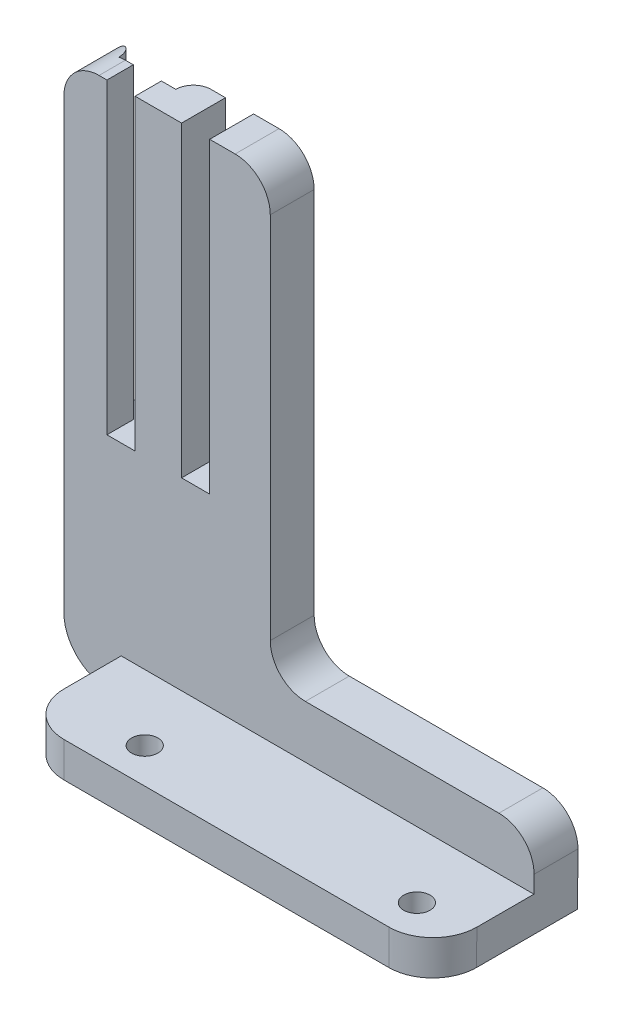
ISO-10303-21;
HEADER;
FILE_DESCRIPTION(('STEP AP214'),'2;1');
FILE_NAME('part.step','',(''),(''),'','','');
FILE_SCHEMA(('AUTOMOTIVE_DESIGN { 1 0 10303 214 1 1 1 1 }'));
ENDSEC;
DATA;
#1=APPLICATION_CONTEXT('core data for automotive mechanical design processes');
#2=APPLICATION_PROTOCOL_DEFINITION('international standard','automotive_design',2000,#1);
#3=PRODUCT_CONTEXT('',#1,'mechanical');
#4=PRODUCT('Part','Part','',(#3));
#5=PRODUCT_RELATED_PRODUCT_CATEGORY('part','',(#4));
#6=PRODUCT_DEFINITION_FORMATION('','',#4);
#7=PRODUCT_DEFINITION_CONTEXT('part definition',#1,'design');
#8=PRODUCT_DEFINITION('design','',#6,#7);
#9=PRODUCT_DEFINITION_SHAPE('','',#8);
#10=(LENGTH_UNIT() NAMED_UNIT(*) SI_UNIT(.MILLI.,.METRE.));
#11=(NAMED_UNIT(*) PLANE_ANGLE_UNIT() SI_UNIT($,.RADIAN.));
#12=(NAMED_UNIT(*) SI_UNIT($,.STERADIAN.) SOLID_ANGLE_UNIT());
#13=UNCERTAINTY_MEASURE_WITH_UNIT(LENGTH_MEASURE(1.E-05),#10,'distance_accuracy_value','');
#14=(GEOMETRIC_REPRESENTATION_CONTEXT(3) GLOBAL_UNCERTAINTY_ASSIGNED_CONTEXT((#13)) GLOBAL_UNIT_ASSIGNED_CONTEXT((#10,
#11,#12)) REPRESENTATION_CONTEXT('',''));
#15=CARTESIAN_POINT('',(0.,0.,0.));
#16=DIRECTION('',(0.,0.,1.));
#17=DIRECTION('',(1.,0.,0.));
#18=AXIS2_PLACEMENT_3D('',#15,#16,#17);
#19=CARTESIAN_POINT('',(-20.8166666666667,0.,5.));
#20=DIRECTION('',(1.,0.,0.));
#21=DIRECTION('',(0.,1.,0.));
#22=AXIS2_PLACEMENT_3D('',#19,#20,#21);
#23=PLANE('',#22);
#24=DIRECTION('',(0.,0.,-1.));
#25=VECTOR('',#24,1.);
#26=CARTESIAN_POINT('',(-20.8166666666667,35.,5.));
#27=LINE('',#26,#25);
#28=CARTESIAN_POINT('',(-20.8166666666667,35.,5.));
#29=VERTEX_POINT('',#28);
#30=CARTESIAN_POINT('',(-20.8166666666667,35.,2.));
#31=VERTEX_POINT('',#30);
#32=EDGE_CURVE('E337',#29,#31,#27,.T.);
#33=ORIENTED_EDGE('',*,*,#32,.T.);
#34=DIRECTION('',(0.,-1.,0.));
#35=VECTOR('',#34,1.);
#36=CARTESIAN_POINT('',(-20.8166666666667,0.,2.));
#37=LINE('',#36,#35);
#38=CARTESIAN_POINT('',(-20.8166666666667,0.,2.));
#39=VERTEX_POINT('',#38);
#40=EDGE_CURVE('E238',#31,#39,#37,.T.);
#41=ORIENTED_EDGE('',*,*,#40,.T.);
#42=DIRECTION('',(0.,0.,-1.));
#43=VECTOR('',#42,1.);
#44=CARTESIAN_POINT('',(-20.8166666666667,0.,5.));
#45=LINE('',#44,#43);
#46=CARTESIAN_POINT('',(-20.8166666666667,0.,5.));
#47=VERTEX_POINT('',#46);
#48=EDGE_CURVE('E288',#47,#39,#45,.T.);
#49=ORIENTED_EDGE('',*,*,#48,.F.);
#50=DIRECTION('',(0.,-1.,0.));
#51=VECTOR('',#50,1.);
#52=CARTESIAN_POINT('',(-20.8166666666667,0.,5.));
#53=LINE('',#52,#51);
#54=EDGE_CURVE('E362',#29,#47,#53,.T.);
#55=ORIENTED_EDGE('',*,*,#54,.F.);
#56=EDGE_LOOP('',(#33,#41,#49,#55));
#57=FACE_BOUND('',#56,.T.);
#58=ADVANCED_FACE('F33',(#57),#23,.F.);
#59=CARTESIAN_POINT('',(-20.8166666666667,0.,5.));
#60=DIRECTION('',(0.,-1.,0.));
#61=DIRECTION('',(1.,0.,0.));
#62=AXIS2_PLACEMENT_3D('',#59,#60,#61);
#63=PLANE('',#62);
#64=ORIENTED_EDGE('',*,*,#48,.T.);
#65=DIRECTION('',(1.,0.,0.));
#66=VECTOR('',#65,1.);
#67=CARTESIAN_POINT('',(-25.6666666666667,0.,2.));
#68=LINE('',#67,#66);
#69=CARTESIAN_POINT('',(-19.1666666666667,0.,2.));
#70=VERTEX_POINT('',#69);
#71=EDGE_CURVE('E248',#39,#70,#68,.T.);
#72=ORIENTED_EDGE('',*,*,#71,.T.);
#73=CARTESIAN_POINT('',(-17.1666666666667,0.,2.));
#74=DIRECTION('',(0.,-1.,0.));
#75=DIRECTION('',(1.,0.,0.));
#76=AXIS2_PLACEMENT_3D('',#73,#74,#75);
#77=CIRCLE('',#76,2.);
#78=CARTESIAN_POINT('',(-17.1666666666667,0.,0.));
#79=VERTEX_POINT('',#78);
#80=EDGE_CURVE('E42',#70,#79,#77,.T.);
#81=ORIENTED_EDGE('',*,*,#80,.T.);
#82=DIRECTION('',(-1.,0.,0.));
#83=VECTOR('',#82,1.);
#84=CARTESIAN_POINT('',(-20.8166666666667,0.,0.));
#85=LINE('',#84,#83);
#86=CARTESIAN_POINT('',(-27.6666666666667,0.,0.));
#87=VERTEX_POINT('',#86);
#88=EDGE_CURVE('E49',#79,#87,#85,.T.);
#89=ORIENTED_EDGE('',*,*,#88,.T.);
#90=CARTESIAN_POINT('',(-27.6666666666667,0.,2.));
#91=DIRECTION('',(0.,-1.,0.));
#92=DIRECTION('',(1.,0.,0.));
#93=AXIS2_PLACEMENT_3D('',#90,#91,#92);
#94=CIRCLE('',#93,2.);
#95=CARTESIAN_POINT('',(-25.6666666666667,0.,2.));
#96=VERTEX_POINT('',#95);
#97=EDGE_CURVE('E11',#87,#96,#94,.T.);
#98=ORIENTED_EDGE('',*,*,#97,.T.);
#99=CARTESIAN_POINT('',(-24.0166666666667,0.,2.));
#100=VERTEX_POINT('',#99);
#101=EDGE_CURVE('E243',#96,#100,#68,.T.);
#102=ORIENTED_EDGE('',*,*,#101,.T.);
#103=DIRECTION('',(0.,0.,-1.));
#104=VECTOR('',#103,1.);
#105=CARTESIAN_POINT('',(-24.0166666666667,0.,5.));
#106=LINE('',#105,#104);
#107=CARTESIAN_POINT('',(-24.0166666666667,0.,5.));
#108=VERTEX_POINT('',#107);
#109=EDGE_CURVE('E380',#108,#100,#106,.T.);
#110=ORIENTED_EDGE('',*,*,#109,.F.);
#111=DIRECTION('',(-1.,0.,0.));
#112=VECTOR('',#111,1.);
#113=CARTESIAN_POINT('',(-20.8166666666667,0.,5.));
#114=LINE('',#113,#112);
#115=EDGE_CURVE('E388',#47,#108,#114,.T.);
#116=ORIENTED_EDGE('',*,*,#115,.F.);
#117=EDGE_LOOP('',(#64,#72,#81,#89,#98,#102,#110,#116));
#118=FACE_BOUND('',#117,.T.);
#119=ADVANCED_FACE('F387',(#118),#63,.F.);
#120=CARTESIAN_POINT('',(-24.0166666666667,0.,5.));
#121=DIRECTION('',(-1.,0.,0.));
#122=DIRECTION('',(0.,-1.,0.));
#123=AXIS2_PLACEMENT_3D('',#120,#121,#122);
#124=PLANE('',#123);
#125=ORIENTED_EDGE('',*,*,#109,.T.);
#126=DIRECTION('',(0.,1.,0.));
#127=VECTOR('',#126,1.);
#128=CARTESIAN_POINT('',(-24.0166666666667,0.,2.));
#129=LINE('',#128,#127);
#130=CARTESIAN_POINT('',(-24.0166666666667,35.,2.));
#131=VERTEX_POINT('',#130);
#132=EDGE_CURVE('E242',#100,#131,#129,.T.);
#133=ORIENTED_EDGE('',*,*,#132,.T.);
#134=DIRECTION('',(0.,0.,-1.));
#135=VECTOR('',#134,1.);
#136=CARTESIAN_POINT('',(-24.0166666666667,35.,5.));
#137=LINE('',#136,#135);
#138=CARTESIAN_POINT('',(-24.0166666666667,35.,5.));
#139=VERTEX_POINT('',#138);
#140=EDGE_CURVE('E378',#139,#131,#137,.T.);
#141=ORIENTED_EDGE('',*,*,#140,.F.);
#142=DIRECTION('',(0.,1.,0.));
#143=VECTOR('',#142,1.);
#144=CARTESIAN_POINT('',(-24.0166666666667,0.,5.));
#145=LINE('',#144,#143);
#146=EDGE_CURVE('E545',#108,#139,#145,.T.);
#147=ORIENTED_EDGE('',*,*,#146,.F.);
#148=EDGE_LOOP('',(#125,#133,#141,#147));
#149=FACE_BOUND('',#148,.T.);
#150=ADVANCED_FACE('F452',(#149),#124,.F.);
#151=CARTESIAN_POINT('',(-24.0166666666667,35.,5.));
#152=DIRECTION('',(0.,-1.,0.));
#153=DIRECTION('',(0.,0.,-1.));
#154=AXIS2_PLACEMENT_3D('',#151,#152,#153);
#155=PLANE('',#154);
#156=ORIENTED_EDGE('',*,*,#140,.T.);
#157=DIRECTION('',(1.,0.,0.));
#158=VECTOR('',#157,1.);
#159=CARTESIAN_POINT('',(-25.6666666666667,35.,2.));
#160=LINE('',#159,#158);
#161=CARTESIAN_POINT('',(-24.9166666666667,35.,2.));
#162=VERTEX_POINT('',#161);
#163=EDGE_CURVE('E239',#162,#131,#160,.T.);
#164=ORIENTED_EDGE('',*,*,#163,.F.);
#165=DIRECTION('',(0.,0.,-1.));
#166=VECTOR('',#165,1.);
#167=CARTESIAN_POINT('',(-24.9166666666667,35.,5.));
#168=LINE('',#167,#166);
#169=CARTESIAN_POINT('',(-24.9166666666667,35.,5.));
#170=VERTEX_POINT('',#169);
#171=EDGE_CURVE('E487',#162,#170,#168,.F.);
#172=ORIENTED_EDGE('',*,*,#171,.T.);
#173=DIRECTION('',(-1.,0.,0.));
#174=VECTOR('',#173,1.);
#175=CARTESIAN_POINT('',(-24.0166666666667,35.,5.));
#176=LINE('',#175,#174);
#177=EDGE_CURVE('E540',#139,#170,#176,.T.);
#178=ORIENTED_EDGE('',*,*,#177,.F.);
#179=EDGE_LOOP('',(#156,#164,#172,#178));
#180=FACE_BOUND('',#179,.T.);
#181=ADVANCED_FACE('F532',(#180),#155,.F.);
#182=CARTESIAN_POINT('',(-28.9166666666667,-25.,5.));
#183=DIRECTION('',(1.,0.,0.));
#184=DIRECTION('',(0.,0.,-1.));
#185=AXIS2_PLACEMENT_3D('',#182,#183,#184);
#186=PLANE('',#185);
#187=DIRECTION('',(0.,-1.,0.));
#188=VECTOR('',#187,1.);
#189=CARTESIAN_POINT('',(-28.9166666666667,-25.,0.));
#190=LINE('',#189,#188);
#191=CARTESIAN_POINT('',(-28.9166666666667,31.,0.));
#192=VERTEX_POINT('',#191);
#193=CARTESIAN_POINT('',(-28.9166666666667,-20.,0.));
#194=VERTEX_POINT('',#193);
#195=EDGE_CURVE('E339',#192,#194,#190,.T.);
#196=ORIENTED_EDGE('',*,*,#195,.T.);
#197=DIRECTION('',(0.,0.,-1.));
#198=VECTOR('',#197,1.);
#199=CARTESIAN_POINT('',(-28.9166666666667,-20.,5.));
#200=LINE('',#199,#198);
#201=CARTESIAN_POINT('',(-28.9166666666667,-20.,5.));
#202=VERTEX_POINT('',#201);
#203=EDGE_CURVE('E521',#194,#202,#200,.F.);
#204=ORIENTED_EDGE('',*,*,#203,.T.);
#205=DIRECTION('',(0.,-1.,0.));
#206=VECTOR('',#205,1.);
#207=CARTESIAN_POINT('',(-28.9166666666667,-25.,5.));
#208=LINE('',#207,#206);
#209=CARTESIAN_POINT('',(-28.9166666666667,31.,5.));
#210=VERTEX_POINT('',#209);
#211=EDGE_CURVE('E516',#210,#202,#208,.T.);
#212=ORIENTED_EDGE('',*,*,#211,.F.);
#213=DIRECTION('',(0.,0.,-1.));
#214=VECTOR('',#213,1.);
#215=CARTESIAN_POINT('',(-28.9166666666667,31.,5.));
#216=LINE('',#215,#214);
#217=EDGE_CURVE('E475',#210,#192,#216,.T.);
#218=ORIENTED_EDGE('',*,*,#217,.T.);
#219=EDGE_LOOP('',(#196,#204,#212,#218));
#220=FACE_BOUND('',#219,.T.);
#221=ADVANCED_FACE('F542',(#220),#186,.F.);
#222=CARTESIAN_POINT('',(24.5834077517131,-25.,5.));
#223=DIRECTION('',(0.,1.,0.));
#224=DIRECTION('',(0.,0.,1.));
#225=AXIS2_PLACEMENT_3D('',#222,#223,#224);
#226=PLANE('',#225);
#227=CARTESIAN_POINT('',(18.7852470457038,-25.,12.5014817246109));
#228=DIRECTION('',(0.,1.,0.));
#229=DIRECTION('',(0.,0.,1.));
#230=AXIS2_PLACEMENT_3D('',#227,#228,#229);
#231=CIRCLE('',#230,1.5);
#232=CARTESIAN_POINT('',(18.7852470457038,-25.,14.0014817246109));
#233=VERTEX_POINT('',#232);
#234=EDGE_CURVE('E257',#233,#233,#231,.F.);
#235=ORIENTED_EDGE('',*,*,#234,.F.);
#236=EDGE_LOOP('',(#235));
#237=FACE_BOUND('',#236,.T.);
#238=CARTESIAN_POINT('',(-12.2147529542962,-25.,12.5014817246109));
#239=DIRECTION('',(0.,1.,0.));
#240=DIRECTION('',(0.,0.,1.));
#241=AXIS2_PLACEMENT_3D('',#238,#239,#240);
#242=CIRCLE('',#241,1.5);
#243=CARTESIAN_POINT('',(-12.2147529542962,-25.,14.0014817246109));
#244=VERTEX_POINT('',#243);
#245=EDGE_CURVE('E263',#244,#244,#242,.F.);
#246=ORIENTED_EDGE('',*,*,#245,.F.);
#247=EDGE_LOOP('',(#246));
#248=FACE_BOUND('',#247,.T.);
#249=DIRECTION('',(1.,0.,0.));
#250=VECTOR('',#249,1.);
#251=CARTESIAN_POINT('',(24.5834077517131,-25.,5.));
#252=LINE('',#251,#250);
#253=CARTESIAN_POINT('',(-23.9166666666667,-25.,5.));
#254=VERTEX_POINT('',#253);
#255=CARTESIAN_POINT('',(-22.3948764519901,-25.,5.));
#256=VERTEX_POINT('',#255);
#257=EDGE_CURVE('E315',#254,#256,#252,.T.);
#258=ORIENTED_EDGE('',*,*,#257,.F.);
#259=DIRECTION('',(0.,0.,-1.));
#260=VECTOR('',#259,1.);
#261=CARTESIAN_POINT('',(-23.9166666666667,-25.,5.));
#262=LINE('',#261,#260);
#263=CARTESIAN_POINT('',(-23.9166666666667,-25.,0.));
#264=VERTEX_POINT('',#263);
#265=EDGE_CURVE('E514',#254,#264,#262,.T.);
#266=ORIENTED_EDGE('',*,*,#265,.T.);
#267=DIRECTION('',(1.,0.,0.));
#268=VECTOR('',#267,1.);
#269=CARTESIAN_POINT('',(24.5834077517131,-25.,0.));
#270=LINE('',#269,#268);
#271=CARTESIAN_POINT('',(24.5834077517131,-25.,0.));
#272=VERTEX_POINT('',#271);
#273=EDGE_CURVE('E342',#264,#272,#270,.T.);
#274=ORIENTED_EDGE('',*,*,#273,.T.);
#275=DIRECTION('',(0.,0.,-1.));
#276=VECTOR('',#275,1.);
#277=CARTESIAN_POINT('',(24.5834077517131,-25.,5.));
#278=LINE('',#277,#276);
#279=CARTESIAN_POINT('',(24.5834077517131,-25.,11.5));
#280=VERTEX_POINT('',#279);
#281=EDGE_CURVE('E375',#280,#272,#278,.T.);
#282=ORIENTED_EDGE('',*,*,#281,.F.);
#283=CARTESIAN_POINT('',(19.5832589149536,-25.,11.5));
#284=DIRECTION('',(0.,1.,0.));
#285=DIRECTION('',(1.,0.,0.));
#286=AXIS2_PLACEMENT_3D('',#283,#284,#285);
#287=ELLIPSE('',#286,5.00014883675949,5.);
#288=CARTESIAN_POINT('',(19.5832589149536,-25.,16.5));
#289=VERTEX_POINT('',#288);
#290=EDGE_CURVE('E291',#280,#289,#287,.F.);
#291=ORIENTED_EDGE('',*,*,#290,.T.);
#292=DIRECTION('',(1.,0.,0.));
#293=VECTOR('',#292,1.);
#294=CARTESIAN_POINT('',(-22.3948764519902,-25.,16.5));
#295=LINE('',#294,#293);
#296=CARTESIAN_POINT('',(-17.3948764519902,-25.,16.5));
#297=VERTEX_POINT('',#296);
#298=EDGE_CURVE('E267',#297,#289,#295,.T.);
#299=ORIENTED_EDGE('',*,*,#298,.F.);
#300=CARTESIAN_POINT('',(-17.3948764519902,-25.,11.5));
#301=DIRECTION('',(0.,1.,0.));
#302=DIRECTION('',(0.,0.,1.));
#303=AXIS2_PLACEMENT_3D('',#300,#301,#302);
#304=CIRCLE('',#303,5.);
#305=CARTESIAN_POINT('',(-22.3948764519902,-25.,11.5));
#306=VERTEX_POINT('',#305);
#307=EDGE_CURVE('E297',#297,#306,#304,.F.);
#308=ORIENTED_EDGE('',*,*,#307,.T.);
#309=DIRECTION('',(0.,0.,-1.));
#310=VECTOR('',#309,1.);
#311=CARTESIAN_POINT('',(-22.3948764519902,-25.,16.5));
#312=LINE('',#311,#310);
#313=EDGE_CURVE('E292',#306,#256,#312,.T.);
#314=ORIENTED_EDGE('',*,*,#313,.T.);
#315=EDGE_LOOP('',(#258,#266,#274,#282,#291,#299,#308,#314));
#316=FACE_BOUND('',#315,.T.);
#317=ADVANCED_FACE('F555',(#237,#248,#316),#226,.F.);
#318=CARTESIAN_POINT('',(24.5834077517131,-25.,5.));
#319=DIRECTION('',(-0.999970233534172,0.00771570123931044,0.));
#320=DIRECTION('',(-0.00771570123931045,-0.999970233534172,0.));
#321=AXIS2_PLACEMENT_3D('',#318,#319,#320);
#322=PLANE('',#321);
#323=DIRECTION('',(0.00771570123931044,0.999970233534171,0.));
#324=VECTOR('',#323,1.);
#325=CARTESIAN_POINT('',(24.5834077517131,-25.,0.));
#326=LINE('',#325,#324);
#327=CARTESIAN_POINT('',(24.629465201934,-19.0308628049572,0.));
#328=VERTEX_POINT('',#327);
#329=EDGE_CURVE('E344',#272,#328,#326,.T.);
#330=ORIENTED_EDGE('',*,*,#329,.T.);
#331=DIRECTION('',(0.,0.,-1.));
#332=VECTOR('',#331,1.);
#333=CARTESIAN_POINT('',(24.629465201934,-19.0308628049572,5.));
#334=LINE('',#333,#332);
#335=CARTESIAN_POINT('',(24.629465201934,-19.0308628049572,5.));
#336=VERTEX_POINT('',#335);
#337=EDGE_CURVE('E500',#328,#336,#334,.F.);
#338=ORIENTED_EDGE('',*,*,#337,.T.);
#339=DIRECTION('',(0.00771570123931044,0.999970233534171,0.));
#340=VECTOR('',#339,1.);
#341=CARTESIAN_POINT('',(24.5834077517131,-25.,5.));
#342=LINE('',#341,#340);
#343=CARTESIAN_POINT('',(24.6142714753743,-21.,5.));
#344=VERTEX_POINT('',#343);
#345=EDGE_CURVE('E310',#344,#336,#342,.T.);
#346=ORIENTED_EDGE('',*,*,#345,.F.);
#347=DIRECTION('',(0.,0.,-1.));
#348=VECTOR('',#347,1.);
#349=CARTESIAN_POINT('',(24.6142714753743,-21.,16.5));
#350=LINE('',#349,#348);
#351=CARTESIAN_POINT('',(24.6142714753743,-21.,11.5));
#352=VERTEX_POINT('',#351);
#353=EDGE_CURVE('E295',#352,#344,#350,.T.);
#354=ORIENTED_EDGE('',*,*,#353,.F.);
#355=DIRECTION('',(0.00771570123931045,0.999970233534172,0.));
#356=VECTOR('',#355,1.);
#357=CARTESIAN_POINT('',(24.5834077517131,-25.,11.5));
#358=LINE('',#357,#356);
#359=EDGE_CURVE('E474',#352,#280,#358,.F.);
#360=ORIENTED_EDGE('',*,*,#359,.T.);
#361=ORIENTED_EDGE('',*,*,#281,.T.);
#362=EDGE_LOOP('',(#330,#338,#346,#354,#360,#361));
#363=FACE_BOUND('',#362,.T.);
#364=ADVANCED_FACE('F566',(#363),#322,.F.);
#365=CARTESIAN_POINT('',(24.6605670608661,-15.,5.));
#366=DIRECTION('',(0.,-1.,0.));
#367=DIRECTION('',(1.,0.,0.));
#368=AXIS2_PLACEMENT_3D('',#365,#366,#367);
#369=PLANE('',#368);
#370=DIRECTION('',(-1.,0.,0.));
#371=VECTOR('',#370,1.);
#372=CARTESIAN_POINT('',(24.6605670608661,-15.,5.));
#373=LINE('',#372,#371);
#374=CARTESIAN_POINT('',(20.6295842677973,-15.,5.));
#375=VERTEX_POINT('',#374);
#376=CARTESIAN_POINT('',(-1.41666666666663,-15.,5.));
#377=VERTEX_POINT('',#376);
#378=EDGE_CURVE('E314',#375,#377,#373,.T.);
#379=ORIENTED_EDGE('',*,*,#378,.F.);
#380=DIRECTION('',(0.,0.,-1.));
#381=VECTOR('',#380,1.);
#382=CARTESIAN_POINT('',(20.6295842677973,-15.,5.));
#383=LINE('',#382,#381);
#384=CARTESIAN_POINT('',(20.6295842677973,-15.,0.));
#385=VERTEX_POINT('',#384);
#386=EDGE_CURVE('E497',#375,#385,#383,.T.);
#387=ORIENTED_EDGE('',*,*,#386,.T.);
#388=DIRECTION('',(-1.,0.,0.));
#389=VECTOR('',#388,1.);
#390=CARTESIAN_POINT('',(24.6605670608661,-15.,0.));
#391=LINE('',#390,#389);
#392=CARTESIAN_POINT('',(-1.41666666666663,-15.,0.));
#393=VERTEX_POINT('',#392);
#394=EDGE_CURVE('E347',#385,#393,#391,.T.);
#395=ORIENTED_EDGE('',*,*,#394,.T.);
#396=DIRECTION('',(0.,0.,-1.));
#397=VECTOR('',#396,1.);
#398=CARTESIAN_POINT('',(-1.41666666666662,-15.,5.));
#399=LINE('',#398,#397);
#400=EDGE_CURVE('E495',#393,#377,#399,.F.);
#401=ORIENTED_EDGE('',*,*,#400,.T.);
#402=EDGE_LOOP('',(#379,#387,#395,#401));
#403=FACE_BOUND('',#402,.T.);
#404=ADVANCED_FACE('F608',(#403),#369,.F.);
#405=CARTESIAN_POINT('',(-5.41666666666662,-15.,5.));
#406=DIRECTION('',(-1.,0.,0.));
#407=DIRECTION('',(0.,-1.,0.));
#408=AXIS2_PLACEMENT_3D('',#405,#406,#407);
#409=PLANE('',#408);
#410=DIRECTION('',(0.,1.,0.));
#411=VECTOR('',#410,1.);
#412=CARTESIAN_POINT('',(-5.41666666666662,-15.,5.));
#413=LINE('',#412,#411);
#414=CARTESIAN_POINT('',(-5.41666666666662,-11.,5.));
#415=VERTEX_POINT('',#414);
#416=CARTESIAN_POINT('',(-5.41666666666665,31.,5.));
#417=VERTEX_POINT('',#416);
#418=EDGE_CURVE('E324',#415,#417,#413,.T.);
#419=ORIENTED_EDGE('',*,*,#418,.F.);
#420=DIRECTION('',(0.,0.,-1.));
#421=VECTOR('',#420,1.);
#422=CARTESIAN_POINT('',(-5.41666666666662,-11.,0.));
#423=LINE('',#422,#421);
#424=CARTESIAN_POINT('',(-5.41666666666662,-11.,0.));
#425=VERTEX_POINT('',#424);
#426=EDGE_CURVE('E504',#415,#425,#423,.T.);
#427=ORIENTED_EDGE('',*,*,#426,.T.);
#428=DIRECTION('',(0.,1.,0.));
#429=VECTOR('',#428,1.);
#430=CARTESIAN_POINT('',(-5.41666666666662,-15.,0.));
#431=LINE('',#430,#429);
#432=CARTESIAN_POINT('',(-5.41666666666665,31.,0.));
#433=VERTEX_POINT('',#432);
#434=EDGE_CURVE('E350',#425,#433,#431,.T.);
#435=ORIENTED_EDGE('',*,*,#434,.T.);
#436=DIRECTION('',(0.,0.,-1.));
#437=VECTOR('',#436,1.);
#438=CARTESIAN_POINT('',(-5.41666666666665,31.,5.));
#439=LINE('',#438,#437);
#440=EDGE_CURVE('E502',#433,#417,#439,.F.);
#441=ORIENTED_EDGE('',*,*,#440,.T.);
#442=EDGE_LOOP('',(#419,#427,#435,#441));
#443=FACE_BOUND('',#442,.T.);
#444=ADVANCED_FACE('F604',(#443),#409,.F.);
#445=CARTESIAN_POINT('',(-5.41666666666665,35.,5.));
#446=DIRECTION('',(0.,-1.,0.));
#447=DIRECTION('',(1.,0.,0.));
#448=AXIS2_PLACEMENT_3D('',#445,#446,#447);
#449=PLANE('',#448);
#450=DIRECTION('',(-1.,0.,0.));
#451=VECTOR('',#450,1.);
#452=CARTESIAN_POINT('',(-5.41666666666665,35.,5.));
#453=LINE('',#452,#451);
#454=CARTESIAN_POINT('',(-9.41666666666665,35.,5.));
#455=VERTEX_POINT('',#454);
#456=CARTESIAN_POINT('',(-12.3166666666666,35.,5.));
#457=VERTEX_POINT('',#456);
#458=EDGE_CURVE('E327',#455,#457,#453,.T.);
#459=ORIENTED_EDGE('',*,*,#458,.F.);
#460=DIRECTION('',(0.,0.,-1.));
#461=VECTOR('',#460,1.);
#462=CARTESIAN_POINT('',(-9.41666666666665,35.,5.));
#463=LINE('',#462,#461);
#464=CARTESIAN_POINT('',(-9.41666666666665,35.,0.));
#465=VERTEX_POINT('',#464);
#466=EDGE_CURVE('E507',#455,#465,#463,.T.);
#467=ORIENTED_EDGE('',*,*,#466,.T.);
#468=DIRECTION('',(-1.,0.,0.));
#469=VECTOR('',#468,1.);
#470=CARTESIAN_POINT('',(-5.41666666666665,35.,0.));
#471=LINE('',#470,#469);
#472=CARTESIAN_POINT('',(-12.3166666666666,35.,0.));
#473=VERTEX_POINT('',#472);
#474=EDGE_CURVE('E353',#465,#473,#471,.T.);
#475=ORIENTED_EDGE('',*,*,#474,.T.);
#476=DIRECTION('',(0.,0.,-1.));
#477=VECTOR('',#476,1.);
#478=CARTESIAN_POINT('',(-12.3166666666666,35.,5.));
#479=LINE('',#478,#477);
#480=EDGE_CURVE('E372',#457,#473,#479,.T.);
#481=ORIENTED_EDGE('',*,*,#480,.F.);
#482=EDGE_LOOP('',(#459,#467,#475,#481));
#483=FACE_BOUND('',#482,.T.);
#484=ADVANCED_FACE('F600',(#483),#449,.F.);
#485=CARTESIAN_POINT('',(-12.3166666666666,0.,5.));
#486=DIRECTION('',(1.,0.,0.));
#487=DIRECTION('',(0.,1.,0.));
#488=AXIS2_PLACEMENT_3D('',#485,#486,#487);
#489=PLANE('',#488);
#490=DIRECTION('',(0.,-1.,0.));
#491=VECTOR('',#490,1.);
#492=CARTESIAN_POINT('',(-12.3166666666666,0.,0.));
#493=LINE('',#492,#491);
#494=CARTESIAN_POINT('',(-12.3166666666666,0.,0.));
#495=VERTEX_POINT('',#494);
#496=EDGE_CURVE('E355',#473,#495,#493,.T.);
#497=ORIENTED_EDGE('',*,*,#496,.T.);
#498=DIRECTION('',(0.,0.,-1.));
#499=VECTOR('',#498,1.);
#500=CARTESIAN_POINT('',(-12.3166666666666,0.,5.));
#501=LINE('',#500,#499);
#502=CARTESIAN_POINT('',(-12.3166666666666,0.,5.));
#503=VERTEX_POINT('',#502);
#504=EDGE_CURVE('E369',#503,#495,#501,.T.);
#505=ORIENTED_EDGE('',*,*,#504,.F.);
#506=DIRECTION('',(0.,-1.,0.));
#507=VECTOR('',#506,1.);
#508=CARTESIAN_POINT('',(-12.3166666666666,0.,5.));
#509=LINE('',#508,#507);
#510=EDGE_CURVE('E329',#457,#503,#509,.T.);
#511=ORIENTED_EDGE('',*,*,#510,.F.);
#512=ORIENTED_EDGE('',*,*,#480,.T.);
#513=EDGE_LOOP('',(#497,#505,#511,#512));
#514=FACE_BOUND('',#513,.T.);
#515=ADVANCED_FACE('F596',(#514),#489,.F.);
#516=CARTESIAN_POINT('',(-12.3166666666666,0.,5.));
#517=DIRECTION('',(0.,-1.,0.));
#518=DIRECTION('',(1.,0.,0.));
#519=AXIS2_PLACEMENT_3D('',#516,#517,#518);
#520=PLANE('',#519);
#521=DIRECTION('',(-1.,0.,0.));
#522=VECTOR('',#521,1.);
#523=CARTESIAN_POINT('',(-12.3166666666666,0.,0.));
#524=LINE('',#523,#522);
#525=CARTESIAN_POINT('',(-15.5166666666666,0.,0.));
#526=VERTEX_POINT('',#525);
#527=EDGE_CURVE('E357',#495,#526,#524,.T.);
#528=ORIENTED_EDGE('',*,*,#527,.T.);
#529=DIRECTION('',(0.,0.,-1.));
#530=VECTOR('',#529,1.);
#531=CARTESIAN_POINT('',(-15.5166666666666,0.,5.));
#532=LINE('',#531,#530);
#533=CARTESIAN_POINT('',(-15.5166666666666,0.,5.));
#534=VERTEX_POINT('',#533);
#535=EDGE_CURVE('E366',#534,#526,#532,.T.);
#536=ORIENTED_EDGE('',*,*,#535,.F.);
#537=DIRECTION('',(-1.,0.,0.));
#538=VECTOR('',#537,1.);
#539=CARTESIAN_POINT('',(-12.3166666666666,0.,5.));
#540=LINE('',#539,#538);
#541=EDGE_CURVE('E331',#503,#534,#540,.T.);
#542=ORIENTED_EDGE('',*,*,#541,.F.);
#543=ORIENTED_EDGE('',*,*,#504,.T.);
#544=EDGE_LOOP('',(#528,#536,#542,#543));
#545=FACE_BOUND('',#544,.T.);
#546=ADVANCED_FACE('F593',(#545),#520,.F.);
#547=CARTESIAN_POINT('',(-15.5166666666666,0.,5.));
#548=DIRECTION('',(-1.,0.,0.));
#549=DIRECTION('',(0.,-1.,0.));
#550=AXIS2_PLACEMENT_3D('',#547,#548,#549);
#551=PLANE('',#550);
#552=DIRECTION('',(0.,1.,0.));
#553=VECTOR('',#552,1.);
#554=CARTESIAN_POINT('',(-15.5166666666666,0.,0.));
#555=LINE('',#554,#553);
#556=CARTESIAN_POINT('',(-15.5166666666666,35.,0.));
#557=VERTEX_POINT('',#556);
#558=EDGE_CURVE('E359',#526,#557,#555,.T.);
#559=ORIENTED_EDGE('',*,*,#558,.T.);
#560=DIRECTION('',(0.,0.,-1.));
#561=VECTOR('',#560,1.);
#562=CARTESIAN_POINT('',(-15.5166666666666,35.,5.));
#563=LINE('',#562,#561);
#564=CARTESIAN_POINT('',(-15.5166666666666,35.,5.));
#565=VERTEX_POINT('',#564);
#566=EDGE_CURVE('E364',#565,#557,#563,.T.);
#567=ORIENTED_EDGE('',*,*,#566,.F.);
#568=DIRECTION('',(0.,1.,0.));
#569=VECTOR('',#568,1.);
#570=CARTESIAN_POINT('',(-15.5166666666666,0.,5.));
#571=LINE('',#570,#569);
#572=EDGE_CURVE('E333',#534,#565,#571,.T.);
#573=ORIENTED_EDGE('',*,*,#572,.F.);
#574=ORIENTED_EDGE('',*,*,#535,.T.);
#575=EDGE_LOOP('',(#559,#567,#573,#574));
#576=FACE_BOUND('',#575,.T.);
#577=ADVANCED_FACE('F401',(#576),#551,.F.);
#578=CARTESIAN_POINT('',(-15.5166666666666,35.,5.));
#579=DIRECTION('',(0.,-1.,0.));
#580=DIRECTION('',(0.,0.,-1.));
#581=AXIS2_PLACEMENT_3D('',#578,#579,#580);
#582=PLANE('',#581);
#583=DIRECTION('',(-1.,0.,0.));
#584=VECTOR('',#583,1.);
#585=CARTESIAN_POINT('',(-15.5166666666666,35.,0.));
#586=LINE('',#585,#584);
#587=CARTESIAN_POINT('',(-17.1666666666667,35.,0.));
#588=VERTEX_POINT('',#587);
#589=EDGE_CURVE('E225',#557,#588,#586,.T.);
#590=ORIENTED_EDGE('',*,*,#589,.T.);
#591=CARTESIAN_POINT('',(-17.1666666666667,35.,2.));
#592=DIRECTION('',(0.,-1.,0.));
#593=DIRECTION('',(0.,0.,-1.));
#594=AXIS2_PLACEMENT_3D('',#591,#592,#593);
#595=CIRCLE('',#594,2.);
#596=CARTESIAN_POINT('',(-19.1666666666667,35.,2.));
#597=VERTEX_POINT('',#596);
#598=EDGE_CURVE('E217',#588,#597,#595,.F.);
#599=ORIENTED_EDGE('',*,*,#598,.T.);
#600=EDGE_CURVE('E221',#31,#597,#160,.T.);
#601=ORIENTED_EDGE('',*,*,#600,.F.);
#602=ORIENTED_EDGE('',*,*,#32,.F.);
#603=DIRECTION('',(-1.,0.,0.));
#604=VECTOR('',#603,1.);
#605=CARTESIAN_POINT('',(-15.5166666666666,35.,5.));
#606=LINE('',#605,#604);
#607=EDGE_CURVE('E335',#565,#29,#606,.T.);
#608=ORIENTED_EDGE('',*,*,#607,.F.);
#609=ORIENTED_EDGE('',*,*,#566,.T.);
#610=EDGE_LOOP('',(#590,#599,#601,#602,#608,#609));
#611=FACE_BOUND('',#610,.T.);
#612=ADVANCED_FACE('F219',(#611),#582,.F.);
#613=CARTESIAN_POINT('',(0.,0.,5.));
#614=DIRECTION('',(0.,0.,1.));
#615=DIRECTION('',(1.,0.,0.));
#616=AXIS2_PLACEMENT_3D('',#613,#614,#615);
#617=PLANE('',#616);
#618=ORIENTED_EDGE('',*,*,#211,.T.);
#619=CARTESIAN_POINT('',(-23.9166666666667,-20.,5.));
#620=DIRECTION('',(0.,0.,1.));
#621=DIRECTION('',(1.,0.,0.));
#622=AXIS2_PLACEMENT_3D('',#619,#620,#621);
#623=CIRCLE('',#622,5.);
#624=EDGE_CURVE('E523',#202,#254,#623,.T.);
#625=ORIENTED_EDGE('',*,*,#624,.T.);
#626=ORIENTED_EDGE('',*,*,#257,.T.);
#627=DIRECTION('',(0.,-1.,0.));
#628=VECTOR('',#627,1.);
#629=CARTESIAN_POINT('',(-22.3948764519902,-25.,5.));
#630=LINE('',#629,#628);
#631=CARTESIAN_POINT('',(-22.3948764519902,-21.,5.));
#632=VERTEX_POINT('',#631);
#633=EDGE_CURVE('E266',#632,#256,#630,.T.);
#634=ORIENTED_EDGE('',*,*,#633,.F.);
#635=DIRECTION('',(-1.,0.,0.));
#636=VECTOR('',#635,1.);
#637=CARTESIAN_POINT('',(-22.3948764519902,-21.,5.));
#638=LINE('',#637,#636);
#639=EDGE_CURVE('E271',#344,#632,#638,.T.);
#640=ORIENTED_EDGE('',*,*,#639,.F.);
#641=ORIENTED_EDGE('',*,*,#345,.T.);
#642=CARTESIAN_POINT('',(20.6295842677973,-19.,5.));
#643=DIRECTION('',(0.,0.,1.));
#644=DIRECTION('',(1.,0.,0.));
#645=AXIS2_PLACEMENT_3D('',#642,#643,#644);
#646=CIRCLE('',#645,4.);
#647=EDGE_CURVE('E491',#336,#375,#646,.T.);
#648=ORIENTED_EDGE('',*,*,#647,.T.);
#649=ORIENTED_EDGE('',*,*,#378,.T.);
#650=CARTESIAN_POINT('',(-1.41666666666662,-11.,5.));
#651=DIRECTION('',(0.,0.,1.));
#652=DIRECTION('',(1.,0.,0.));
#653=AXIS2_PLACEMENT_3D('',#650,#651,#652);
#654=CIRCLE('',#653,4.);
#655=EDGE_CURVE('E512',#377,#415,#654,.F.);
#656=ORIENTED_EDGE('',*,*,#655,.T.);
#657=ORIENTED_EDGE('',*,*,#418,.T.);
#658=CARTESIAN_POINT('',(-9.41666666666665,31.,5.));
#659=DIRECTION('',(0.,0.,1.));
#660=DIRECTION('',(1.,0.,0.));
#661=AXIS2_PLACEMENT_3D('',#658,#659,#660);
#662=CIRCLE('',#661,4.);
#663=EDGE_CURVE('E489',#417,#455,#662,.T.);
#664=ORIENTED_EDGE('',*,*,#663,.T.);
#665=ORIENTED_EDGE('',*,*,#458,.T.);
#666=ORIENTED_EDGE('',*,*,#510,.T.);
#667=ORIENTED_EDGE('',*,*,#541,.T.);
#668=ORIENTED_EDGE('',*,*,#572,.T.);
#669=ORIENTED_EDGE('',*,*,#607,.T.);
#670=ORIENTED_EDGE('',*,*,#54,.T.);
#671=ORIENTED_EDGE('',*,*,#115,.T.);
#672=ORIENTED_EDGE('',*,*,#146,.T.);
#673=ORIENTED_EDGE('',*,*,#177,.T.);
#674=CARTESIAN_POINT('',(-24.9166666666667,31.,5.));
#675=DIRECTION('',(0.,0.,1.));
#676=DIRECTION('',(1.,0.,0.));
#677=AXIS2_PLACEMENT_3D('',#674,#675,#676);
#678=CIRCLE('',#677,4.);
#679=EDGE_CURVE('E493',#170,#210,#678,.T.);
#680=ORIENTED_EDGE('',*,*,#679,.T.);
#681=EDGE_LOOP('',(#618,#625,#626,#634,#640,#641,#648,#649,#656,#657,#664,#665,#666,#667,#668,
#669,#670,#671,#672,#673,#680));
#682=FACE_BOUND('',#681,.T.);
#683=ADVANCED_FACE('F396',(#682),#617,.T.);
#684=CARTESIAN_POINT('',(0.,0.,0.));
#685=DIRECTION('',(0.,0.,1.));
#686=DIRECTION('',(1.,0.,0.));
#687=AXIS2_PLACEMENT_3D('',#684,#685,#686);
#688=PLANE('',#687);
#689=ORIENTED_EDGE('',*,*,#88,.F.);
#690=DIRECTION('',(0.,1.,0.));
#691=VECTOR('',#690,1.);
#692=CARTESIAN_POINT('',(-17.1666666666667,0.,0.));
#693=LINE('',#692,#691);
#694=EDGE_CURVE('E230',#79,#588,#693,.T.);
#695=ORIENTED_EDGE('',*,*,#694,.T.);
#696=ORIENTED_EDGE('',*,*,#589,.F.);
#697=ORIENTED_EDGE('',*,*,#558,.F.);
#698=ORIENTED_EDGE('',*,*,#527,.F.);
#699=ORIENTED_EDGE('',*,*,#496,.F.);
#700=ORIENTED_EDGE('',*,*,#474,.F.);
#701=CARTESIAN_POINT('',(-9.41666666666665,31.,0.));
#702=DIRECTION('',(0.,0.,1.));
#703=DIRECTION('',(1.,0.,0.));
#704=AXIS2_PLACEMENT_3D('',#701,#702,#703);
#705=CIRCLE('',#704,4.);
#706=EDGE_CURVE('E480',#465,#433,#705,.F.);
#707=ORIENTED_EDGE('',*,*,#706,.T.);
#708=ORIENTED_EDGE('',*,*,#434,.F.);
#709=CARTESIAN_POINT('',(-1.41666666666662,-11.,0.));
#710=DIRECTION('',(0.,0.,1.));
#711=DIRECTION('',(1.,0.,0.));
#712=AXIS2_PLACEMENT_3D('',#709,#710,#711);
#713=CIRCLE('',#712,4.);
#714=EDGE_CURVE('E510',#425,#393,#713,.T.);
#715=ORIENTED_EDGE('',*,*,#714,.T.);
#716=ORIENTED_EDGE('',*,*,#394,.F.);
#717=CARTESIAN_POINT('',(20.6295842677973,-19.,0.));
#718=DIRECTION('',(0.,0.,1.));
#719=DIRECTION('',(1.,0.,0.));
#720=AXIS2_PLACEMENT_3D('',#717,#718,#719);
#721=CIRCLE('',#720,4.);
#722=EDGE_CURVE('E482',#385,#328,#721,.F.);
#723=ORIENTED_EDGE('',*,*,#722,.T.);
#724=ORIENTED_EDGE('',*,*,#329,.F.);
#725=ORIENTED_EDGE('',*,*,#273,.F.);
#726=CARTESIAN_POINT('',(-23.9166666666667,-20.,0.));
#727=DIRECTION('',(0.,0.,1.));
#728=DIRECTION('',(1.,0.,0.));
#729=AXIS2_PLACEMENT_3D('',#726,#727,#728);
#730=CIRCLE('',#729,5.);
#731=EDGE_CURVE('E519',#264,#194,#730,.F.);
#732=ORIENTED_EDGE('',*,*,#731,.T.);
#733=ORIENTED_EDGE('',*,*,#195,.F.);
#734=CARTESIAN_POINT('',(-24.9166666666667,31.,0.));
#735=DIRECTION('',(0.,0.,1.));
#736=DIRECTION('',(1.,0.,0.));
#737=AXIS2_PLACEMENT_3D('',#734,#735,#736);
#738=CIRCLE('',#737,4.);
#739=CARTESIAN_POINT('',(-27.6666666666667,33.9047375096556,0.));
#740=VERTEX_POINT('',#739);
#741=EDGE_CURVE('E484',#192,#740,#738,.F.);
#742=ORIENTED_EDGE('',*,*,#741,.T.);
#743=DIRECTION('',(0.,-1.,0.));
#744=VECTOR('',#743,1.);
#745=CARTESIAN_POINT('',(-27.6666666666667,0.,0.));
#746=LINE('',#745,#744);
#747=EDGE_CURVE('E406',#740,#87,#746,.T.);
#748=ORIENTED_EDGE('',*,*,#747,.T.);
#749=EDGE_LOOP('',(#689,#695,#696,#697,#698,#699,#700,#707,#708,#715,#716,#723,#724,#725,#732,
#733,#742,#748));
#750=FACE_BOUND('',#749,.T.);
#751=ADVANCED_FACE('F404',(#750),#688,.F.);
#752=CARTESIAN_POINT('',(-22.3948764519902,-25.,16.5));
#753=DIRECTION('',(1.,0.,0.));
#754=DIRECTION('',(0.,0.,-1.));
#755=AXIS2_PLACEMENT_3D('',#752,#753,#754);
#756=PLANE('',#755);
#757=ORIENTED_EDGE('',*,*,#313,.F.);
#758=DIRECTION('',(0.,-1.,0.));
#759=VECTOR('',#758,1.);
#760=CARTESIAN_POINT('',(-22.3948764519902,-25.,11.5));
#761=LINE('',#760,#759);
#762=CARTESIAN_POINT('',(-22.3948764519902,-21.,11.5));
#763=VERTEX_POINT('',#762);
#764=EDGE_CURVE('E299',#306,#763,#761,.F.);
#765=ORIENTED_EDGE('',*,*,#764,.T.);
#766=DIRECTION('',(0.,0.,-1.));
#767=VECTOR('',#766,1.);
#768=CARTESIAN_POINT('',(-22.3948764519902,-21.,16.5));
#769=LINE('',#768,#767);
#770=EDGE_CURVE('E274',#763,#632,#769,.T.);
#771=ORIENTED_EDGE('',*,*,#770,.T.);
#772=ORIENTED_EDGE('',*,*,#633,.T.);
#773=EDGE_LOOP('',(#757,#765,#771,#772));
#774=FACE_BOUND('',#773,.T.);
#775=ADVANCED_FACE('F559',(#774),#756,.F.);
#776=CARTESIAN_POINT('',(-22.3948764519902,-21.,16.5));
#777=DIRECTION('',(0.,-1.,0.));
#778=DIRECTION('',(0.,0.,-1.));
#779=AXIS2_PLACEMENT_3D('',#776,#777,#778);
#780=PLANE('',#779);
#781=CARTESIAN_POINT('',(18.7852470457038,-21.,12.5014817246109));
#782=DIRECTION('',(0.,1.,0.));
#783=DIRECTION('',(0.,0.,-1.));
#784=AXIS2_PLACEMENT_3D('',#781,#782,#783);
#785=CIRCLE('',#784,1.5);
#786=CARTESIAN_POINT('',(18.7852470457038,-21.,11.0014817246109));
#787=VERTEX_POINT('',#786);
#788=EDGE_CURVE('E254',#787,#787,#785,.T.);
#789=ORIENTED_EDGE('',*,*,#788,.F.);
#790=EDGE_LOOP('',(#789));
#791=FACE_BOUND('',#790,.T.);
#792=CARTESIAN_POINT('',(-12.2147529542962,-21.,12.5014817246109));
#793=DIRECTION('',(0.,1.,0.));
#794=DIRECTION('',(0.,0.,1.));
#795=AXIS2_PLACEMENT_3D('',#792,#793,#794);
#796=CIRCLE('',#795,1.5);
#797=CARTESIAN_POINT('',(-12.2147529542962,-21.,14.0014817246109));
#798=VERTEX_POINT('',#797);
#799=EDGE_CURVE('E260',#798,#798,#796,.T.);
#800=ORIENTED_EDGE('',*,*,#799,.F.);
#801=EDGE_LOOP('',(#800));
#802=FACE_BOUND('',#801,.T.);
#803=ORIENTED_EDGE('',*,*,#770,.F.);
#804=CARTESIAN_POINT('',(-17.3948764519902,-21.,11.5));
#805=DIRECTION('',(0.,-1.,0.));
#806=DIRECTION('',(0.,0.,-1.));
#807=AXIS2_PLACEMENT_3D('',#804,#805,#806);
#808=CIRCLE('',#807,5.);
#809=CARTESIAN_POINT('',(-17.3948764519902,-21.,16.5));
#810=VERTEX_POINT('',#809);
#811=EDGE_CURVE('E470',#763,#810,#808,.F.);
#812=ORIENTED_EDGE('',*,*,#811,.T.);
#813=DIRECTION('',(-1.,0.,0.));
#814=VECTOR('',#813,1.);
#815=CARTESIAN_POINT('',(-22.3948764519902,-21.,16.5));
#816=LINE('',#815,#814);
#817=CARTESIAN_POINT('',(19.6141226386148,-21.,16.5));
#818=VERTEX_POINT('',#817);
#819=EDGE_CURVE('E270',#818,#810,#816,.T.);
#820=ORIENTED_EDGE('',*,*,#819,.F.);
#821=CARTESIAN_POINT('',(19.6141226386148,-21.,11.5));
#822=DIRECTION('',(0.,-1.,0.));
#823=DIRECTION('',(1.,0.,0.));
#824=AXIS2_PLACEMENT_3D('',#821,#822,#823);
#825=ELLIPSE('',#824,5.00014883675949,5.);
#826=EDGE_CURVE('E301',#818,#352,#825,.F.);
#827=ORIENTED_EDGE('',*,*,#826,.T.);
#828=ORIENTED_EDGE('',*,*,#353,.T.);
#829=ORIENTED_EDGE('',*,*,#639,.T.);
#830=EDGE_LOOP('',(#803,#812,#820,#827,#828,#829));
#831=FACE_BOUND('',#830,.T.);
#832=ADVANCED_FACE('F562',(#791,#802,#831),#780,.F.);
#833=CARTESIAN_POINT('',(0.,0.,16.5));
#834=DIRECTION('',(0.,0.,-1.));
#835=DIRECTION('',(-1.,0.,0.));
#836=AXIS2_PLACEMENT_3D('',#833,#834,#835);
#837=PLANE('',#836);
#838=ORIENTED_EDGE('',*,*,#819,.T.);
#839=DIRECTION('',(0.,-1.,0.));
#840=VECTOR('',#839,1.);
#841=CARTESIAN_POINT('',(-17.3948764519902,0.,16.5));
#842=LINE('',#841,#840);
#843=EDGE_CURVE('E287',#810,#297,#842,.T.);
#844=ORIENTED_EDGE('',*,*,#843,.T.);
#845=ORIENTED_EDGE('',*,*,#298,.T.);
#846=DIRECTION('',(0.00771570123931045,0.999970233534172,0.));
#847=VECTOR('',#846,1.);
#848=CARTESIAN_POINT('',(19.7749798727444,-0.15258237854963,16.5));
#849=LINE('',#848,#847);
#850=EDGE_CURVE('E284',#289,#818,#849,.T.);
#851=ORIENTED_EDGE('',*,*,#850,.T.);
#852=EDGE_LOOP('',(#838,#844,#845,#851));
#853=FACE_BOUND('',#852,.T.);
#854=ADVANCED_FACE('F571',(#853),#837,.F.);
#855=CARTESIAN_POINT('',(-12.2147529542962,-29.2426406871193,12.5014817246109));
#856=DIRECTION('',(0.,1.,0.));
#857=DIRECTION('',(0.,0.,1.));
#858=AXIS2_PLACEMENT_3D('',#855,#856,#857);
#859=CYLINDRICAL_SURFACE('',#858,1.5);
#860=ORIENTED_EDGE('',*,*,#245,.T.);
#861=EDGE_LOOP('',(#860));
#862=FACE_BOUND('',#861,.T.);
#863=ORIENTED_EDGE('',*,*,#799,.T.);
#864=EDGE_LOOP('',(#863));
#865=FACE_BOUND('',#864,.T.);
#866=ADVANCED_FACE('F464',(#862,#865),#859,.F.);
#867=CARTESIAN_POINT('',(18.7852470457038,-29.2426406871193,12.5014817246109));
#868=DIRECTION('',(0.,1.,0.));
#869=DIRECTION('',(0.,0.,1.));
#870=AXIS2_PLACEMENT_3D('',#867,#868,#869);
#871=CYLINDRICAL_SURFACE('',#870,1.5);
#872=ORIENTED_EDGE('',*,*,#234,.T.);
#873=EDGE_LOOP('',(#872));
#874=FACE_BOUND('',#873,.T.);
#875=ORIENTED_EDGE('',*,*,#788,.T.);
#876=EDGE_LOOP('',(#875));
#877=FACE_BOUND('',#876,.T.);
#878=ADVANCED_FACE('F457',(#874,#877),#871,.F.);
#879=CARTESIAN_POINT('',(-17.3948764519902,0.,11.5));
#880=DIRECTION('',(0.,-1.,0.));
#881=DIRECTION('',(0.,0.,-1.));
#882=AXIS2_PLACEMENT_3D('',#879,#880,#881);
#883=CYLINDRICAL_SURFACE('',#882,5.);
#884=ORIENTED_EDGE('',*,*,#811,.F.);
#885=ORIENTED_EDGE('',*,*,#764,.F.);
#886=ORIENTED_EDGE('',*,*,#307,.F.);
#887=ORIENTED_EDGE('',*,*,#843,.F.);
#888=EDGE_LOOP('',(#884,#885,#886,#887));
#889=FACE_BOUND('',#888,.T.);
#890=ADVANCED_FACE('F455',(#889),#883,.T.);
#891=CARTESIAN_POINT('',(19.7749798727444,-0.15258237854963,11.5));
#892=DIRECTION('',(0.00771570123931045,0.999970233534172,0.));
#893=DIRECTION('',(-0.999970233534172,0.00771570123931044,0.));
#894=AXIS2_PLACEMENT_3D('',#891,#892,#893);
#895=CYLINDRICAL_SURFACE('',#894,5.);
#896=ORIENTED_EDGE('',*,*,#290,.F.);
#897=ORIENTED_EDGE('',*,*,#359,.F.);
#898=ORIENTED_EDGE('',*,*,#826,.F.);
#899=ORIENTED_EDGE('',*,*,#850,.F.);
#900=EDGE_LOOP('',(#896,#897,#898,#899));
#901=FACE_BOUND('',#900,.T.);
#902=ADVANCED_FACE('F422',(#901),#895,.T.);
#903=CARTESIAN_POINT('',(-24.9166666666667,31.,5.));
#904=DIRECTION('',(0.,0.,-1.));
#905=DIRECTION('',(-1.,0.,0.));
#906=AXIS2_PLACEMENT_3D('',#903,#904,#905);
#907=CYLINDRICAL_SURFACE('',#906,4.);
#908=CARTESIAN_POINT('',(-24.9166666666667,31.,2.));
#909=DIRECTION('',(0.,0.,1.));
#910=DIRECTION('',(1.,0.,0.));
#911=AXIS2_PLACEMENT_3D('',#908,#909,#910);
#912=CIRCLE('',#911,4.);
#913=CARTESIAN_POINT('',(-25.6666666666667,34.9290584113754,2.));
#914=VERTEX_POINT('',#913);
#915=EDGE_CURVE('E408',#914,#162,#912,.F.);
#916=ORIENTED_EDGE('',*,*,#915,.F.);
#917=CARTESIAN_POINT('',(-25.6666666666667,34.9290584113754,2.));
#918=CARTESIAN_POINT('',(-25.6666610062845,34.9290510698953,1.94519859949115));
#919=CARTESIAN_POINT('',(-25.6689190497522,34.928628240744,1.89039915583821));
#920=CARTESIAN_POINT('',(-25.6779193467984,34.9268986307763,1.78118324582796));
#921=CARTESIAN_POINT('',(-25.6846616454484,34.9255918410752,1.7267667833256));
#922=CARTESIAN_POINT('',(-25.7025890875214,34.9220409684687,1.61868596004969));
#923=CARTESIAN_POINT('',(-25.713775139711,34.919796693839,1.56502175544154));
#924=CARTESIAN_POINT('',(-25.7404879570376,34.9142690898327,1.45885627502013));
#925=CARTESIAN_POINT('',(-25.7560146184414,34.9109857852871,1.40635497144785));
#926=CARTESIAN_POINT('',(-25.8089716967434,34.8993745210156,1.25106444920007));
#927=CARTESIAN_POINT('',(-25.8527793283926,34.8892851905845,1.15048789743175));
#928=CARTESIAN_POINT('',(-25.9557585021678,34.8630413776914,0.958529116708096));
#929=CARTESIAN_POINT('',(-26.0149205679344,34.8468906334441,0.867141264822057));
#930=CARTESIAN_POINT('',(-26.1453232276356,34.8072251989094,0.697390493946067));
#931=CARTESIAN_POINT('',(-26.2163746273532,34.7838215992706,0.61885671363846));
#932=CARTESIAN_POINT('',(-26.3680748111488,34.7282593496298,0.475349533686029));
#933=CARTESIAN_POINT('',(-26.4487220134956,34.6961021414132,0.410373904022193));
#934=CARTESIAN_POINT('',(-26.6142243634817,34.6230237332316,0.296398623822208));
#935=CARTESIAN_POINT('',(-26.6989582835823,34.5822971468623,0.247096875692372));
#936=CARTESIAN_POINT('',(-26.8705770423469,34.4916546964203,0.162775465510884));
#937=CARTESIAN_POINT('',(-26.9574626747638,34.441735396158,0.127761159823296));
#938=CARTESIAN_POINT('',(-27.1343845749112,34.3306411886881,0.0697747843951657));
#939=CARTESIAN_POINT('',(-27.2243670267182,34.2690351066302,0.0474756541357434));
#940=CARTESIAN_POINT('',(-27.4002638022733,34.1374825367584,0.0158073439490924));
#941=CARTESIAN_POINT('',(-27.4861801008392,34.0675401569517,0.00643182384068381));
#942=CARTESIAN_POINT('',(-27.6021320301019,33.964835587415,0.000767634861691219));
#943=CARTESIAN_POINT('',(-27.6346641624479,33.935045490151,-1.86635805176586E-06));
#944=CARTESIAN_POINT('',(-27.6666666666667,33.9047375096556,0.));
#945=B_SPLINE_CURVE_WITH_KNOTS('',3,(#917,#918,#919,#920,#921,#922,#923,#924,#925,#926,#927,
#928,#929,#930,#931,#932,#933,#934,#935,#936,#937,#938,#939,#940,#941,#942,#943,#944),
.UNSPECIFIED.,.F.,.F.,(4,2,2,2,2,2,2,2,2,2,2,2,2,4),(0.,0.164352404674044,0.328706461293022,
0.493094146332571,0.657477903118441,0.986243248816151,1.31480616958131,1.63856643855118,
1.96227341399531,2.27929825864263,2.59644184698893,2.92910088368686,3.2615966633629,
3.39387931401735),.UNSPECIFIED.);
#946=EDGE_CURVE('E229',#914,#740,#945,.T.);
#947=ORIENTED_EDGE('',*,*,#946,.T.);
#948=ORIENTED_EDGE('',*,*,#741,.F.);
#949=ORIENTED_EDGE('',*,*,#217,.F.);
#950=ORIENTED_EDGE('',*,*,#679,.F.);
#951=ORIENTED_EDGE('',*,*,#171,.F.);
#952=EDGE_LOOP('',(#916,#947,#948,#949,#950,#951));
#953=FACE_BOUND('',#952,.T.);
#954=ADVANCED_FACE('F416',(#953),#907,.T.);
#955=CARTESIAN_POINT('',(20.6295842677973,-19.,5.));
#956=DIRECTION('',(0.,0.,-1.));
#957=DIRECTION('',(-1.,0.,0.));
#958=AXIS2_PLACEMENT_3D('',#955,#956,#957);
#959=CYLINDRICAL_SURFACE('',#958,4.);
#960=ORIENTED_EDGE('',*,*,#647,.F.);
#961=ORIENTED_EDGE('',*,*,#337,.F.);
#962=ORIENTED_EDGE('',*,*,#722,.F.);
#963=ORIENTED_EDGE('',*,*,#386,.F.);
#964=EDGE_LOOP('',(#960,#961,#962,#963));
#965=FACE_BOUND('',#964,.T.);
#966=ADVANCED_FACE('F421',(#965),#959,.T.);
#967=CARTESIAN_POINT('',(-1.41666666666662,-11.,5.));
#968=DIRECTION('',(0.,0.,1.));
#969=DIRECTION('',(1.,0.,0.));
#970=AXIS2_PLACEMENT_3D('',#967,#968,#969);
#971=CYLINDRICAL_SURFACE('',#970,4.);
#972=ORIENTED_EDGE('',*,*,#655,.F.);
#973=ORIENTED_EDGE('',*,*,#400,.F.);
#974=ORIENTED_EDGE('',*,*,#714,.F.);
#975=ORIENTED_EDGE('',*,*,#426,.F.);
#976=EDGE_LOOP('',(#972,#973,#974,#975));
#977=FACE_BOUND('',#976,.T.);
#978=ADVANCED_FACE('F427',(#977),#971,.F.);
#979=CARTESIAN_POINT('',(-9.41666666666665,31.,5.));
#980=DIRECTION('',(0.,0.,-1.));
#981=DIRECTION('',(-1.,0.,0.));
#982=AXIS2_PLACEMENT_3D('',#979,#980,#981);
#983=CYLINDRICAL_SURFACE('',#982,4.);
#984=ORIENTED_EDGE('',*,*,#663,.F.);
#985=ORIENTED_EDGE('',*,*,#440,.F.);
#986=ORIENTED_EDGE('',*,*,#706,.F.);
#987=ORIENTED_EDGE('',*,*,#466,.F.);
#988=EDGE_LOOP('',(#984,#985,#986,#987));
#989=FACE_BOUND('',#988,.T.);
#990=ADVANCED_FACE('F431',(#989),#983,.T.);
#991=CARTESIAN_POINT('',(-23.9166666666667,-20.,5.));
#992=DIRECTION('',(0.,0.,-1.));
#993=DIRECTION('',(-1.,0.,0.));
#994=AXIS2_PLACEMENT_3D('',#991,#992,#993);
#995=CYLINDRICAL_SURFACE('',#994,5.);
#996=ORIENTED_EDGE('',*,*,#624,.F.);
#997=ORIENTED_EDGE('',*,*,#203,.F.);
#998=ORIENTED_EDGE('',*,*,#731,.F.);
#999=ORIENTED_EDGE('',*,*,#265,.F.);
#1000=EDGE_LOOP('',(#996,#997,#998,#999));
#1001=FACE_BOUND('',#1000,.T.);
#1002=ADVANCED_FACE('F435',(#1001),#995,.T.);
#1003=CARTESIAN_POINT('',(-25.6666666666667,-7.63216876123688,2.));
#1004=DIRECTION('',(0.,0.,1.));
#1005=DIRECTION('',(1.,0.,0.));
#1006=AXIS2_PLACEMENT_3D('',#1003,#1004,#1005);
#1007=PLANE('',#1006);
#1008=ORIENTED_EDGE('',*,*,#101,.F.);
#1009=DIRECTION('',(0.,1.,0.));
#1010=VECTOR('',#1009,1.);
#1011=CARTESIAN_POINT('',(-25.6666666666667,-7.63216876123688,2.));
#1012=LINE('',#1011,#1010);
#1013=EDGE_CURVE('E251',#96,#914,#1012,.T.);
#1014=ORIENTED_EDGE('',*,*,#1013,.T.);
#1015=ORIENTED_EDGE('',*,*,#915,.T.);
#1016=ORIENTED_EDGE('',*,*,#163,.T.);
#1017=ORIENTED_EDGE('',*,*,#132,.F.);
#1018=EDGE_LOOP('',(#1008,#1014,#1015,#1016,#1017));
#1019=FACE_BOUND('',#1018,.T.);
#1020=ADVANCED_FACE('F438',(#1019),#1007,.F.);
#1021=ORIENTED_EDGE('',*,*,#600,.T.);
#1022=DIRECTION('',(0.,1.,0.));
#1023=VECTOR('',#1022,1.);
#1024=CARTESIAN_POINT('',(-19.1666666666667,-7.63216876123688,2.));
#1025=LINE('',#1024,#1023);
#1026=EDGE_CURVE('E235',#70,#597,#1025,.T.);
#1027=ORIENTED_EDGE('',*,*,#1026,.F.);
#1028=ORIENTED_EDGE('',*,*,#71,.F.);
#1029=ORIENTED_EDGE('',*,*,#40,.F.);
#1030=EDGE_LOOP('',(#1021,#1027,#1028,#1029));
#1031=FACE_BOUND('',#1030,.T.);
#1032=ADVANCED_FACE('F234',(#1031),#1007,.F.);
#1033=CARTESIAN_POINT('',(-17.1666666666667,0.,2.));
#1034=DIRECTION('',(0.,1.,0.));
#1035=DIRECTION('',(0.,0.,1.));
#1036=AXIS2_PLACEMENT_3D('',#1033,#1034,#1035);
#1037=CYLINDRICAL_SURFACE('',#1036,2.);
#1038=ORIENTED_EDGE('',*,*,#80,.F.);
#1039=ORIENTED_EDGE('',*,*,#1026,.T.);
#1040=ORIENTED_EDGE('',*,*,#598,.F.);
#1041=ORIENTED_EDGE('',*,*,#694,.F.);
#1042=EDGE_LOOP('',(#1038,#1039,#1040,#1041));
#1043=FACE_BOUND('',#1042,.T.);
#1044=ADVANCED_FACE('F241',(#1043),#1037,.T.);
#1045=CARTESIAN_POINT('',(-27.6666666666667,0.,2.));
#1046=DIRECTION('',(0.,-1.,0.));
#1047=DIRECTION('',(0.,0.,-1.));
#1048=AXIS2_PLACEMENT_3D('',#1045,#1046,#1047);
#1049=CYLINDRICAL_SURFACE('',#1048,2.);
#1050=ORIENTED_EDGE('',*,*,#946,.F.);
#1051=ORIENTED_EDGE('',*,*,#1013,.F.);
#1052=ORIENTED_EDGE('',*,*,#97,.F.);
#1053=ORIENTED_EDGE('',*,*,#747,.F.);
#1054=EDGE_LOOP('',(#1050,#1051,#1052,#1053));
#1055=FACE_BOUND('',#1054,.T.);
#1056=ADVANCED_FACE('F35',(#1055),#1049,.T.);
#1057=CLOSED_SHELL('',(#58,#119,#150,#181,#221,#317,#364,#404,#444,#484,#515,#546,#577,#612,
#683,#751,#775,#832,#854,#866,#878,#890,#902,#954,#966,#978,#990,#1002,#1020,#1032,#1044,#1056));
#1058=MANIFOLD_SOLID_BREP('B2',#1057);
#1059=ADVANCED_BREP_SHAPE_REPRESENTATION('',(#18,#1058),#14);
#1060=SHAPE_DEFINITION_REPRESENTATION(#9,#1059);
ENDSEC;
END-ISO-10303-21;
